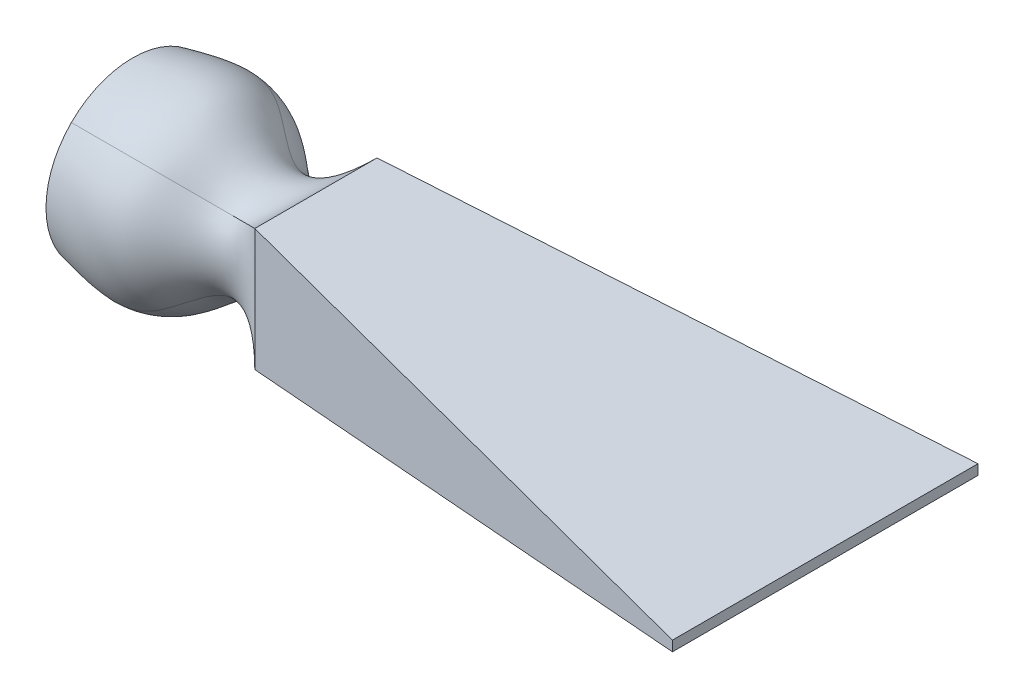
ISO-10303-21;
HEADER;
FILE_DESCRIPTION(('STEP AP214'),'2;1');
FILE_NAME('part.step','',(''),(''),'','','');
FILE_SCHEMA(('AUTOMOTIVE_DESIGN { 1 0 10303 214 1 1 1 1 }'));
ENDSEC;
DATA;
#1=APPLICATION_CONTEXT('core data for automotive mechanical design processes');
#2=APPLICATION_PROTOCOL_DEFINITION('international standard','automotive_design',2000,#1);
#3=PRODUCT_CONTEXT('',#1,'mechanical');
#4=PRODUCT('Part','Part','',(#3));
#5=PRODUCT_RELATED_PRODUCT_CATEGORY('part','',(#4));
#6=PRODUCT_DEFINITION_FORMATION('','',#4);
#7=PRODUCT_DEFINITION_CONTEXT('part definition',#1,'design');
#8=PRODUCT_DEFINITION('design','',#6,#7);
#9=PRODUCT_DEFINITION_SHAPE('','',#8);
#10=(LENGTH_UNIT() NAMED_UNIT(*) SI_UNIT(.MILLI.,.METRE.));
#11=(NAMED_UNIT(*) PLANE_ANGLE_UNIT() SI_UNIT($,.RADIAN.));
#12=(NAMED_UNIT(*) SI_UNIT($,.STERADIAN.) SOLID_ANGLE_UNIT());
#13=UNCERTAINTY_MEASURE_WITH_UNIT(LENGTH_MEASURE(1.E-05),#10,'distance_accuracy_value','');
#14=(GEOMETRIC_REPRESENTATION_CONTEXT(3) GLOBAL_UNCERTAINTY_ASSIGNED_CONTEXT((#13)) GLOBAL_UNIT_ASSIGNED_CONTEXT((#10,
#11,#12)) REPRESENTATION_CONTEXT('',''));
#15=CARTESIAN_POINT('',(0.,0.,0.));
#16=DIRECTION('',(0.,0.,1.));
#17=DIRECTION('',(1.,0.,0.));
#18=AXIS2_PLACEMENT_3D('',#15,#16,#17);
#19=CARTESIAN_POINT('',(0.,0.,0.));
#20=DIRECTION('',(1.,0.,0.));
#21=DIRECTION('',(0.,0.,-1.));
#22=AXIS2_PLACEMENT_3D('',#19,#20,#21);
#23=PLANE('',#22);
#24=CARTESIAN_POINT('',(0.,0.,0.));
#25=DIRECTION('',(1.,0.,0.));
#26=DIRECTION('',(0.,0.,-1.));
#27=AXIS2_PLACEMENT_3D('',#24,#25,#26);
#28=CIRCLE('',#27,42.5);
#29=CARTESIAN_POINT('',(0.,-30.0520382004283,-30.0520382004283));
#30=VERTEX_POINT('',#29);
#31=CARTESIAN_POINT('',(0.,30.0520382004283,-30.0520382004283));
#32=VERTEX_POINT('',#31);
#33=EDGE_CURVE('E261',#30,#32,#28,.T.);
#34=ORIENTED_EDGE('',*,*,#33,.F.);
#35=CARTESIAN_POINT('',(0.,-30.0520382004283,30.0520382004283));
#36=VERTEX_POINT('',#35);
#37=EDGE_CURVE('E177',#36,#30,#28,.T.);
#38=ORIENTED_EDGE('',*,*,#37,.F.);
#39=CARTESIAN_POINT('',(0.,30.0520382004283,30.0520382004283));
#40=VERTEX_POINT('',#39);
#41=EDGE_CURVE('E272',#40,#36,#28,.T.);
#42=ORIENTED_EDGE('',*,*,#41,.F.);
#43=EDGE_CURVE('E268',#32,#40,#28,.T.);
#44=ORIENTED_EDGE('',*,*,#43,.F.);
#45=EDGE_LOOP('',(#34,#38,#42,#44));
#46=FACE_BOUND('',#45,.T.);
#47=ADVANCED_FACE('F79',(#46),#23,.F.);
#48=CARTESIAN_POINT('',(0.,30.0520382004283,30.0520382004283));
#49=CARTESIAN_POINT('',(14.2344827586207,32.4188140013653,32.4188140013653));
#50=CARTESIAN_POINT('',(39.0712716156326,36.653800151363,36.653800151363));
#51=CARTESIAN_POINT('',(63.2956945664266,11.4372483474083,11.4372483474083));
#52=CARTESIAN_POINT('',(81.6580988733623,21.776448903422,21.776448903422));
#53=CARTESIAN_POINT('',(90.,30.,30.));
#54=CARTESIAN_POINT('',(0.,13.4658672388295,46.638209162027));
#55=CARTESIAN_POINT('',(14.2344827586207,14.2547925058085,49.0049849629641));
#56=CARTESIAN_POINT('',(39.0712716156326,16.0203851274969,54.9422523743333));
#57=CARTESIAN_POINT('',(63.2956945664266,6.36613016006294,23.7197125145989));
#58=CARTESIAN_POINT('',(81.6580988733623,7.25881630114066,21.776448903422));
#59=CARTESIAN_POINT('',(90.,10.,30.));
#60=CARTESIAN_POINT('',(0.,-13.4658672388295,46.638209162027));
#61=CARTESIAN_POINT('',(14.2344827586207,-14.2547925058085,49.0049849629641));
#62=CARTESIAN_POINT('',(39.0712716156326,-16.0203851274969,54.9422523743333));
#63=CARTESIAN_POINT('',(63.2956945664266,-6.36613016006293,23.7197125145989));
#64=CARTESIAN_POINT('',(81.6580988733623,-7.25881630114066,21.776448903422));
#65=CARTESIAN_POINT('',(90.,-10.,30.));
#66=CARTESIAN_POINT('',(0.,-30.0520382004283,30.0520382004283));
#67=CARTESIAN_POINT('',(14.2344827586207,-32.4188140013653,32.4188140013653));
#68=CARTESIAN_POINT('',(39.0712716156326,-36.653800151363,36.653800151363));
#69=CARTESIAN_POINT('',(63.2956945664266,-11.4372483474083,11.4372483474083));
#70=CARTESIAN_POINT('',(81.6580988733623,-21.776448903422,21.776448903422));
#71=CARTESIAN_POINT('',(90.,-30.,30.));
#72=B_SPLINE_SURFACE_WITH_KNOTS('',3,3,((#48,#49,#50,#51,#52,#53),(#54,#55,#56,#57,#58,#59),
(#60,#61,#62,#63,#64,#65),(#66,#67,#68,#69,#70,#71)),.UNSPECIFIED.,.F.,.F.,.F.,(4,4),(4,1,1,4),
(0.,1.),(0.,0.406086997524673,0.715894717531625,1.),.UNSPECIFIED.);
#73=CARTESIAN_POINT('',(0.,-30.0520382004283,30.0520382004283));
#74=CARTESIAN_POINT('',(14.2344827586207,-32.4188140013653,32.4188140013653));
#75=CARTESIAN_POINT('',(39.0712716156326,-36.653800151363,36.653800151363));
#76=CARTESIAN_POINT('',(63.2956945664266,-11.4372483474083,11.4372483474083));
#77=CARTESIAN_POINT('',(81.6580988733623,-21.776448903422,21.776448903422));
#78=CARTESIAN_POINT('',(90.,-30.,30.));
#79=B_SPLINE_CURVE_WITH_KNOTS('',3,(#73,#74,#75,#76,#77,#78),.UNSPECIFIED.,.F.,.F.,(4,1,1,4),
(0.,0.406086997524673,0.715894717531625,1.),.UNSPECIFIED.);
#80=CARTESIAN_POINT('',(90.,-30.,30.));
#81=VERTEX_POINT('',#80);
#82=EDGE_CURVE('E332',#36,#81,#79,.T.);
#83=DIRECTION('',(0.,-1.,0.));
#84=VECTOR('',#83,1.);
#85=CARTESIAN_POINT('',(90.,30.,30.));
#86=LINE('',#85,#84);
#87=CARTESIAN_POINT('',(90.,30.,30.));
#88=VERTEX_POINT('',#87);
#89=EDGE_CURVE('E92',#88,#81,#86,.T.);
#90=CARTESIAN_POINT('',(0.,30.0520382004283,30.0520382004283));
#91=CARTESIAN_POINT('',(14.2344827586207,32.4188140013653,32.4188140013653));
#92=CARTESIAN_POINT('',(39.0712716156326,36.653800151363,36.653800151363));
#93=CARTESIAN_POINT('',(63.2956945664266,11.4372483474083,11.4372483474083));
#94=CARTESIAN_POINT('',(81.6580988733623,21.776448903422,21.776448903422));
#95=CARTESIAN_POINT('',(90.,30.,30.));
#96=B_SPLINE_CURVE_WITH_KNOTS('',3,(#90,#91,#92,#93,#94,#95),.UNSPECIFIED.,.F.,.F.,(4,1,1,4),
(0.,0.406086997524673,0.715894717531625,1.),.UNSPECIFIED.);
#97=EDGE_CURVE('E335',#88,#40,#96,.F.);
#98=ORIENTED_EDGE('',*,*,#41,.T.);
#99=ORIENTED_EDGE('',*,*,#82,.T.);
#100=ORIENTED_EDGE('',*,*,#89,.F.);
#101=ORIENTED_EDGE('',*,*,#97,.T.);
#102=EDGE_LOOP('',(#98,#99,#100,#101));
#103=FACE_BOUND('',#102,.T.);
#104=ADVANCED_FACE('F292',(#103),#72,.T.);
#105=CARTESIAN_POINT('',(0.,-30.0520382004283,30.0520382004283));
#106=CARTESIAN_POINT('',(14.2344827586207,-32.4188140013653,32.4188140013653));
#107=CARTESIAN_POINT('',(39.0712716156326,-36.653800151363,36.653800151363));
#108=CARTESIAN_POINT('',(63.2956945664266,-11.4372483474083,11.4372483474083));
#109=CARTESIAN_POINT('',(81.6580988733623,-21.776448903422,21.776448903422));
#110=CARTESIAN_POINT('',(90.,-30.,30.));
#111=CARTESIAN_POINT('',(0.,-46.638209162027,13.4658672388295));
#112=CARTESIAN_POINT('',(14.2344827586207,-49.0049849629641,14.2547925058085));
#113=CARTESIAN_POINT('',(39.0712716156326,-54.9422523743333,16.0203851274969));
#114=CARTESIAN_POINT('',(63.2956945664266,-23.7197125145989,6.36613016006294));
#115=CARTESIAN_POINT('',(81.6580988733623,-21.776448903422,7.25881630114066));
#116=CARTESIAN_POINT('',(90.,-30.,9.99999999999999));
#117=CARTESIAN_POINT('',(0.,-46.638209162027,-13.4658672388295));
#118=CARTESIAN_POINT('',(14.2344827586207,-49.0049849629641,-14.2547925058085));
#119=CARTESIAN_POINT('',(39.0712716156326,-54.9422523743333,-16.0203851274969));
#120=CARTESIAN_POINT('',(63.2956945664266,-23.7197125145989,-6.36613016006293));
#121=CARTESIAN_POINT('',(81.6580988733623,-21.776448903422,-7.25881630114066));
#122=CARTESIAN_POINT('',(90.,-30.,-10.));
#123=CARTESIAN_POINT('',(0.,-30.0520382004283,-30.0520382004283));
#124=CARTESIAN_POINT('',(14.2344827586207,-32.4188140013653,-32.4188140013653));
#125=CARTESIAN_POINT('',(39.0712716156326,-36.653800151363,-36.653800151363));
#126=CARTESIAN_POINT('',(63.2956945664266,-11.4372483474083,-11.4372483474083));
#127=CARTESIAN_POINT('',(81.6580988733623,-21.776448903422,-21.776448903422));
#128=CARTESIAN_POINT('',(90.,-30.,-30.));
#129=B_SPLINE_SURFACE_WITH_KNOTS('',3,3,((#105,#106,#107,#108,#109,#110),(#111,#112,#113,#114,
#115,#116),(#117,#118,#119,#120,#121,#122),(#123,#124,#125,#126,#127,#128)),.UNSPECIFIED.,.F.,
.F.,.F.,(4,4),(4,1,1,4),(0.,1.),(0.,0.406086997524673,0.715894717531625,1.),.UNSPECIFIED.);
#130=CARTESIAN_POINT('',(0.,-30.0520382004283,-30.0520382004283));
#131=CARTESIAN_POINT('',(14.2344827586207,-32.4188140013653,-32.4188140013653));
#132=CARTESIAN_POINT('',(39.0712716156326,-36.653800151363,-36.653800151363));
#133=CARTESIAN_POINT('',(63.2956945664266,-11.4372483474083,-11.4372483474083));
#134=CARTESIAN_POINT('',(81.6580988733623,-21.776448903422,-21.776448903422));
#135=CARTESIAN_POINT('',(90.,-30.,-30.));
#136=B_SPLINE_CURVE_WITH_KNOTS('',3,(#130,#131,#132,#133,#134,#135),.UNSPECIFIED.,.F.,.F.,(4,1,
1,4),(0.,0.406086997524673,0.715894717531625,1.),.UNSPECIFIED.);
#137=CARTESIAN_POINT('',(90.,-30.,-30.));
#138=VERTEX_POINT('',#137);
#139=EDGE_CURVE('E328',#30,#138,#136,.T.);
#140=DIRECTION('',(0.,0.,-1.));
#141=VECTOR('',#140,1.);
#142=CARTESIAN_POINT('',(90.,-30.,30.));
#143=LINE('',#142,#141);
#144=EDGE_CURVE('E308',#81,#138,#143,.T.);
#145=ORIENTED_EDGE('',*,*,#37,.T.);
#146=ORIENTED_EDGE('',*,*,#139,.T.);
#147=ORIENTED_EDGE('',*,*,#144,.F.);
#148=ORIENTED_EDGE('',*,*,#82,.F.);
#149=EDGE_LOOP('',(#145,#146,#147,#148));
#150=FACE_BOUND('',#149,.T.);
#151=ADVANCED_FACE('F346',(#150),#129,.T.);
#152=CARTESIAN_POINT('',(0.,30.0520382004283,-30.0520382004283));
#153=CARTESIAN_POINT('',(14.2344827586207,32.4188140013653,-32.4188140013653));
#154=CARTESIAN_POINT('',(39.0712716156326,36.653800151363,-36.653800151363));
#155=CARTESIAN_POINT('',(63.2956945664266,11.4372483474083,-11.4372483474083));
#156=CARTESIAN_POINT('',(81.6580988733623,21.776448903422,-21.776448903422));
#157=CARTESIAN_POINT('',(90.,30.,-30.));
#158=CARTESIAN_POINT('',(0.,46.638209162027,-13.4658672388295));
#159=CARTESIAN_POINT('',(14.2344827586207,49.0049849629641,-14.2547925058085));
#160=CARTESIAN_POINT('',(39.0712716156326,54.9422523743333,-16.0203851274969));
#161=CARTESIAN_POINT('',(63.2956945664266,23.7197125145989,-6.36613016006294));
#162=CARTESIAN_POINT('',(81.6580988733623,21.776448903422,-7.25881630114066));
#163=CARTESIAN_POINT('',(90.,30.,-9.99999999999999));
#164=CARTESIAN_POINT('',(0.,46.638209162027,13.4658672388295));
#165=CARTESIAN_POINT('',(14.2344827586207,49.0049849629641,14.2547925058085));
#166=CARTESIAN_POINT('',(39.0712716156326,54.9422523743333,16.0203851274969));
#167=CARTESIAN_POINT('',(63.2956945664266,23.7197125145989,6.36613016006294));
#168=CARTESIAN_POINT('',(81.6580988733623,21.776448903422,7.25881630114066));
#169=CARTESIAN_POINT('',(90.,30.,10.));
#170=CARTESIAN_POINT('',(0.,30.0520382004283,30.0520382004283));
#171=CARTESIAN_POINT('',(14.2344827586207,32.4188140013653,32.4188140013653));
#172=CARTESIAN_POINT('',(39.0712716156326,36.653800151363,36.653800151363));
#173=CARTESIAN_POINT('',(63.2956945664266,11.4372483474083,11.4372483474083));
#174=CARTESIAN_POINT('',(81.6580988733623,21.776448903422,21.776448903422));
#175=CARTESIAN_POINT('',(90.,30.,30.));
#176=B_SPLINE_SURFACE_WITH_KNOTS('',3,3,((#152,#153,#154,#155,#156,#157),(#158,#159,#160,#161,
#162,#163),(#164,#165,#166,#167,#168,#169),(#170,#171,#172,#173,#174,#175)),.UNSPECIFIED.,.F.,
.F.,.F.,(4,4),(4,1,1,4),(0.,1.),(0.,0.406086997524673,0.715894717531625,1.),.UNSPECIFIED.);
#177=DIRECTION('',(0.,0.,1.));
#178=VECTOR('',#177,1.);
#179=CARTESIAN_POINT('',(90.,30.,30.));
#180=LINE('',#179,#178);
#181=CARTESIAN_POINT('',(90.,30.,-30.));
#182=VERTEX_POINT('',#181);
#183=EDGE_CURVE('E12',#182,#88,#180,.T.);
#184=CARTESIAN_POINT('',(0.,30.0520382004283,-30.0520382004283));
#185=CARTESIAN_POINT('',(14.2344827586207,32.4188140013653,-32.4188140013653));
#186=CARTESIAN_POINT('',(39.0712716156326,36.653800151363,-36.653800151363));
#187=CARTESIAN_POINT('',(63.2956945664266,11.4372483474083,-11.4372483474083));
#188=CARTESIAN_POINT('',(81.6580988733623,21.776448903422,-21.776448903422));
#189=CARTESIAN_POINT('',(90.,30.,-30.));
#190=B_SPLINE_CURVE_WITH_KNOTS('',3,(#184,#185,#186,#187,#188,#189),.UNSPECIFIED.,.F.,.F.,(4,1,
1,4),(0.,0.406086997524673,0.715894717531625,1.),.UNSPECIFIED.);
#191=EDGE_CURVE('E100',#32,#182,#190,.T.);
#192=ORIENTED_EDGE('',*,*,#43,.T.);
#193=ORIENTED_EDGE('',*,*,#97,.F.);
#194=ORIENTED_EDGE('',*,*,#183,.F.);
#195=ORIENTED_EDGE('',*,*,#191,.F.);
#196=EDGE_LOOP('',(#192,#193,#194,#195));
#197=FACE_BOUND('',#196,.T.);
#198=ADVANCED_FACE('F351',(#197),#176,.T.);
#199=CARTESIAN_POINT('',(0.,-30.0520382004283,-30.0520382004283));
#200=CARTESIAN_POINT('',(14.2344827586207,-32.4188140013653,-32.4188140013653));
#201=CARTESIAN_POINT('',(39.0712716156326,-36.653800151363,-36.653800151363));
#202=CARTESIAN_POINT('',(63.2956945664266,-11.4372483474083,-11.4372483474083));
#203=CARTESIAN_POINT('',(81.6580988733623,-21.776448903422,-21.776448903422));
#204=CARTESIAN_POINT('',(90.,-30.,-30.));
#205=CARTESIAN_POINT('',(0.,-13.4658672388295,-46.638209162027));
#206=CARTESIAN_POINT('',(14.2344827586207,-14.2547925058085,-49.0049849629641));
#207=CARTESIAN_POINT('',(39.0712716156326,-16.0203851274969,-54.9422523743333));
#208=CARTESIAN_POINT('',(63.2956945664266,-6.36613016006294,-23.7197125145989));
#209=CARTESIAN_POINT('',(81.6580988733623,-7.25881630114066,-21.776448903422));
#210=CARTESIAN_POINT('',(90.,-10.,-30.));
#211=CARTESIAN_POINT('',(0.,13.4658672388295,-46.638209162027));
#212=CARTESIAN_POINT('',(14.2344827586207,14.2547925058085,-49.0049849629641));
#213=CARTESIAN_POINT('',(39.0712716156326,16.0203851274969,-54.9422523743333));
#214=CARTESIAN_POINT('',(63.2956945664266,6.36613016006293,-23.7197125145989));
#215=CARTESIAN_POINT('',(81.6580988733623,7.25881630114066,-21.776448903422));
#216=CARTESIAN_POINT('',(90.,10.,-30.));
#217=CARTESIAN_POINT('',(0.,30.0520382004283,-30.0520382004283));
#218=CARTESIAN_POINT('',(14.2344827586207,32.4188140013653,-32.4188140013653));
#219=CARTESIAN_POINT('',(39.0712716156326,36.653800151363,-36.653800151363));
#220=CARTESIAN_POINT('',(63.2956945664266,11.4372483474083,-11.4372483474083));
#221=CARTESIAN_POINT('',(81.6580988733623,21.776448903422,-21.776448903422));
#222=CARTESIAN_POINT('',(90.,30.,-30.));
#223=B_SPLINE_SURFACE_WITH_KNOTS('',3,3,((#199,#200,#201,#202,#203,#204),(#205,#206,#207,#208,
#209,#210),(#211,#212,#213,#214,#215,#216),(#217,#218,#219,#220,#221,#222)),.UNSPECIFIED.,.F.,
.F.,.F.,(4,4),(4,1,1,4),(0.,1.),(0.,0.406086997524673,0.715894717531625,1.),.UNSPECIFIED.);
#224=DIRECTION('',(0.,1.,0.));
#225=VECTOR('',#224,1.);
#226=CARTESIAN_POINT('',(90.,30.,-30.));
#227=LINE('',#226,#225);
#228=EDGE_CURVE('E316',#138,#182,#227,.T.);
#229=ORIENTED_EDGE('',*,*,#33,.T.);
#230=ORIENTED_EDGE('',*,*,#191,.T.);
#231=ORIENTED_EDGE('',*,*,#228,.F.);
#232=ORIENTED_EDGE('',*,*,#139,.F.);
#233=EDGE_LOOP('',(#229,#230,#231,#232));
#234=FACE_BOUND('',#233,.T.);
#235=ADVANCED_FACE('F81',(#234),#223,.T.);
#236=CARTESIAN_POINT('',(340.,0.,0.));
#237=DIRECTION('',(1.,0.,0.));
#238=DIRECTION('',(0.,0.,-1.));
#239=AXIS2_PLACEMENT_3D('',#236,#237,#238);
#240=PLANE('',#239);
#241=DIRECTION('',(0.,1.,0.));
#242=VECTOR('',#241,1.);
#243=CARTESIAN_POINT('',(340.,2.5,-75.));
#244=LINE('',#243,#242);
#245=CARTESIAN_POINT('',(340.,-2.5,-75.));
#246=VERTEX_POINT('',#245);
#247=CARTESIAN_POINT('',(340.,2.5,-75.));
#248=VERTEX_POINT('',#247);
#249=EDGE_CURVE('E167',#246,#248,#244,.T.);
#250=ORIENTED_EDGE('',*,*,#249,.T.);
#251=DIRECTION('',(0.,0.,1.));
#252=VECTOR('',#251,1.);
#253=CARTESIAN_POINT('',(340.,2.5,75.));
#254=LINE('',#253,#252);
#255=CARTESIAN_POINT('',(340.,2.5,75.));
#256=VERTEX_POINT('',#255);
#257=EDGE_CURVE('E146',#248,#256,#254,.T.);
#258=ORIENTED_EDGE('',*,*,#257,.T.);
#259=DIRECTION('',(0.,-1.,0.));
#260=VECTOR('',#259,1.);
#261=CARTESIAN_POINT('',(340.,2.5,75.));
#262=LINE('',#261,#260);
#263=CARTESIAN_POINT('',(340.,-2.5,75.));
#264=VERTEX_POINT('',#263);
#265=EDGE_CURVE('E137',#256,#264,#262,.T.);
#266=ORIENTED_EDGE('',*,*,#265,.T.);
#267=DIRECTION('',(0.,0.,-1.));
#268=VECTOR('',#267,1.);
#269=CARTESIAN_POINT('',(340.,-2.5,75.));
#270=LINE('',#269,#268);
#271=EDGE_CURVE('E142',#264,#246,#270,.T.);
#272=ORIENTED_EDGE('',*,*,#271,.T.);
#273=EDGE_LOOP('',(#250,#258,#266,#272));
#274=FACE_BOUND('',#273,.T.);
#275=ADVANCED_FACE('F141',(#274),#240,.T.);
#276=CARTESIAN_POINT('',(4.3365280110661,39.4229819187827,0.));
#277=DIRECTION('',(-0.109340479152898,-0.994004355935433,0.));
#278=DIRECTION('',(0.994004355935433,-0.109340479152898,0.));
#279=AXIS2_PLACEMENT_3D('',#276,#277,#278);
#280=PLANE('',#279);
#281=DIRECTION('',(0.978466086891979,-0.107631269558118,0.176123895640556));
#282=VECTOR('',#281,1.);
#283=CARTESIAN_POINT('',(90.,30.,30.));
#284=LINE('',#283,#282);
#285=EDGE_CURVE('E179',#88,#256,#284,.T.);
#286=ORIENTED_EDGE('',*,*,#285,.T.);
#287=ORIENTED_EDGE('',*,*,#257,.F.);
#288=DIRECTION('',(0.978466086891979,-0.107631269558118,-0.176123895640556));
#289=VECTOR('',#288,1.);
#290=CARTESIAN_POINT('',(90.,30.,-30.));
#291=LINE('',#290,#289);
#292=EDGE_CURVE('E173',#182,#248,#291,.T.);
#293=ORIENTED_EDGE('',*,*,#292,.F.);
#294=ORIENTED_EDGE('',*,*,#183,.T.);
#295=EDGE_LOOP('',(#286,#287,#293,#294));
#296=FACE_BOUND('',#295,.T.);
#297=ADVANCED_FACE('F198',(#296),#280,.F.);
#298=CARTESIAN_POINT('',(-2.40604416892677,0.,-13.3669120495932));
#299=DIRECTION('',(0.177152998315265,0.,0.984183323973695));
#300=DIRECTION('',(0.984183323973695,0.,-0.177152998315265));
#301=AXIS2_PLACEMENT_3D('',#298,#299,#300);
#302=PLANE('',#301);
#303=ORIENTED_EDGE('',*,*,#292,.T.);
#304=ORIENTED_EDGE('',*,*,#249,.F.);
#305=DIRECTION('',(0.978466086891979,0.107631269558118,-0.176123895640556));
#306=VECTOR('',#305,1.);
#307=CARTESIAN_POINT('',(90.,-30.,-30.));
#308=LINE('',#307,#306);
#309=EDGE_CURVE('E165',#138,#246,#308,.T.);
#310=ORIENTED_EDGE('',*,*,#309,.F.);
#311=ORIENTED_EDGE('',*,*,#228,.T.);
#312=EDGE_LOOP('',(#303,#304,#310,#311));
#313=FACE_BOUND('',#312,.T.);
#314=ADVANCED_FACE('F208',(#313),#302,.F.);
#315=CARTESIAN_POINT('',(-2.40604416892677,0.,13.3669120495932));
#316=DIRECTION('',(0.177152998315265,0.,-0.984183323973695));
#317=DIRECTION('',(-0.984183323973695,0.,-0.177152998315265));
#318=AXIS2_PLACEMENT_3D('',#315,#316,#317);
#319=PLANE('',#318);
#320=DIRECTION('',(0.978466086891979,0.107631269558118,0.176123895640556));
#321=VECTOR('',#320,1.);
#322=CARTESIAN_POINT('',(90.,-30.,30.));
#323=LINE('',#322,#321);
#324=EDGE_CURVE('E163',#81,#264,#323,.T.);
#325=ORIENTED_EDGE('',*,*,#324,.T.);
#326=ORIENTED_EDGE('',*,*,#265,.F.);
#327=ORIENTED_EDGE('',*,*,#285,.F.);
#328=ORIENTED_EDGE('',*,*,#89,.T.);
#329=EDGE_LOOP('',(#325,#326,#327,#328));
#330=FACE_BOUND('',#329,.T.);
#331=ADVANCED_FACE('F171',(#330),#319,.F.);
#332=CARTESIAN_POINT('',(4.3365280110661,-39.4229819187827,0.));
#333=DIRECTION('',(-0.109340479152898,0.994004355935433,0.));
#334=DIRECTION('',(-0.994004355935433,-0.109340479152898,0.));
#335=AXIS2_PLACEMENT_3D('',#332,#333,#334);
#336=PLANE('',#335);
#337=ORIENTED_EDGE('',*,*,#309,.T.);
#338=ORIENTED_EDGE('',*,*,#271,.F.);
#339=ORIENTED_EDGE('',*,*,#324,.F.);
#340=ORIENTED_EDGE('',*,*,#144,.T.);
#341=EDGE_LOOP('',(#337,#338,#339,#340));
#342=FACE_BOUND('',#341,.T.);
#343=ADVANCED_FACE('F161',(#342),#336,.F.);
#344=CLOSED_SHELL('',(#47,#104,#151,#198,#235,#275,#297,#314,#331,#343));
#345=MANIFOLD_SOLID_BREP('B2',#344);
#346=ADVANCED_BREP_SHAPE_REPRESENTATION('',(#18,#345),#14);
#347=SHAPE_DEFINITION_REPRESENTATION(#9,#346);
ENDSEC;
END-ISO-10303-21;
